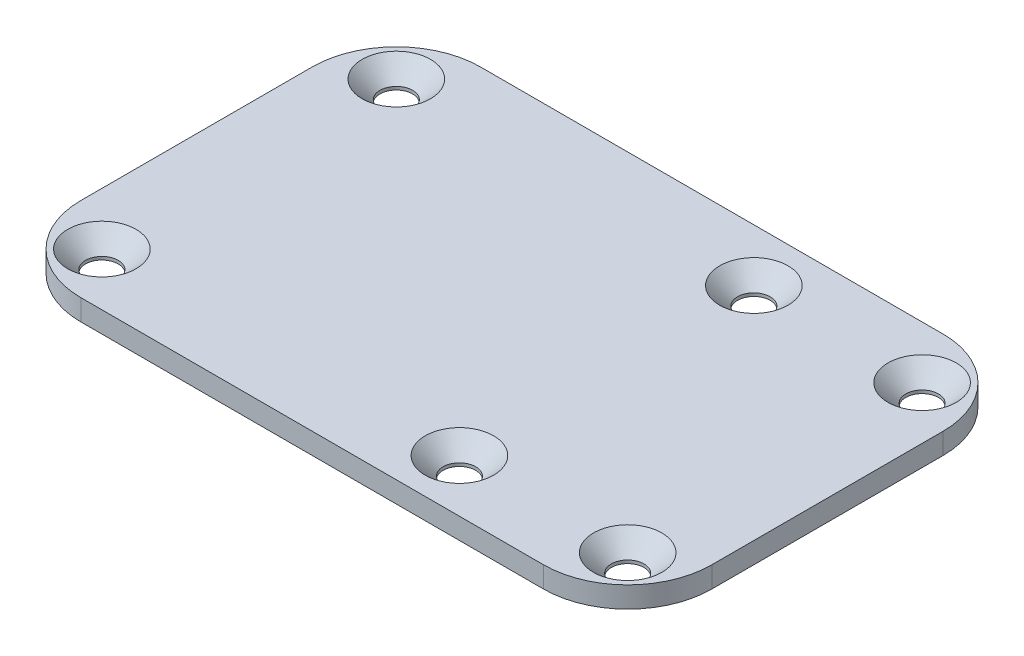
ISO-10303-21;
HEADER;
FILE_DESCRIPTION(('STEP AP214'),'2;1');
FILE_NAME('part.step','',(''),(''),'','','');
FILE_SCHEMA(('AUTOMOTIVE_DESIGN { 1 0 10303 214 1 1 1 1 }'));
ENDSEC;
DATA;
#1=APPLICATION_CONTEXT('core data for automotive mechanical design processes');
#2=APPLICATION_PROTOCOL_DEFINITION('international standard','automotive_design',2000,#1);
#3=PRODUCT_CONTEXT('',#1,'mechanical');
#4=PRODUCT('Part','Part','',(#3));
#5=PRODUCT_RELATED_PRODUCT_CATEGORY('part','',(#4));
#6=PRODUCT_DEFINITION_FORMATION('','',#4);
#7=PRODUCT_DEFINITION_CONTEXT('part definition',#1,'design');
#8=PRODUCT_DEFINITION('design','',#6,#7);
#9=PRODUCT_DEFINITION_SHAPE('','',#8);
#10=(LENGTH_UNIT() NAMED_UNIT(*) SI_UNIT(.MILLI.,.METRE.));
#11=(NAMED_UNIT(*) PLANE_ANGLE_UNIT() SI_UNIT($,.RADIAN.));
#12=(NAMED_UNIT(*) SI_UNIT($,.STERADIAN.) SOLID_ANGLE_UNIT());
#13=UNCERTAINTY_MEASURE_WITH_UNIT(LENGTH_MEASURE(1.E-05),#10,'distance_accuracy_value','');
#14=(GEOMETRIC_REPRESENTATION_CONTEXT(3) GLOBAL_UNCERTAINTY_ASSIGNED_CONTEXT((#13)) GLOBAL_UNIT_ASSIGNED_CONTEXT((#10,
#11,#12)) REPRESENTATION_CONTEXT('',''));
#15=CARTESIAN_POINT('',(0.,0.,0.));
#16=DIRECTION('',(0.,0.,1.));
#17=DIRECTION('',(1.,0.,0.));
#18=AXIS2_PLACEMENT_3D('',#15,#16,#17);
#19=CARTESIAN_POINT('',(22.,2.,-11.));
#20=DIRECTION('',(0.,-1.,0.));
#21=DIRECTION('',(0.,0.,-1.));
#22=AXIS2_PLACEMENT_3D('',#19,#20,#21);
#23=CYLINDRICAL_SURFACE('',#22,8.);
#24=CARTESIAN_POINT('',(22.,0.,-11.));
#25=DIRECTION('',(0.,1.,0.));
#26=DIRECTION('',(0.,0.,1.));
#27=AXIS2_PLACEMENT_3D('',#24,#25,#26);
#28=CIRCLE('',#27,8.);
#29=CARTESIAN_POINT('',(30.,0.,-11.));
#30=VERTEX_POINT('',#29);
#31=CARTESIAN_POINT('',(22.,0.,-19.));
#32=VERTEX_POINT('',#31);
#33=EDGE_CURVE('E130',#30,#32,#28,.T.);
#34=ORIENTED_EDGE('',*,*,#33,.T.);
#35=DIRECTION('',(0.,-1.,0.));
#36=VECTOR('',#35,1.);
#37=CARTESIAN_POINT('',(22.,2.,-19.));
#38=LINE('',#37,#36);
#39=CARTESIAN_POINT('',(22.,2.,-19.));
#40=VERTEX_POINT('',#39);
#41=EDGE_CURVE('E11',#40,#32,#38,.T.);
#42=ORIENTED_EDGE('',*,*,#41,.F.);
#43=CARTESIAN_POINT('',(22.,2.,-11.));
#44=DIRECTION('',(0.,1.,0.));
#45=DIRECTION('',(0.,0.,1.));
#46=AXIS2_PLACEMENT_3D('',#43,#44,#45);
#47=CIRCLE('',#46,8.);
#48=CARTESIAN_POINT('',(30.,2.,-11.));
#49=VERTEX_POINT('',#48);
#50=EDGE_CURVE('E145',#49,#40,#47,.T.);
#51=ORIENTED_EDGE('',*,*,#50,.F.);
#52=DIRECTION('',(0.,-1.,0.));
#53=VECTOR('',#52,1.);
#54=CARTESIAN_POINT('',(30.,2.,-11.));
#55=LINE('',#54,#53);
#56=EDGE_CURVE('E126',#49,#30,#55,.T.);
#57=ORIENTED_EDGE('',*,*,#56,.T.);
#58=EDGE_LOOP('',(#34,#42,#51,#57));
#59=FACE_BOUND('',#58,.T.);
#60=ADVANCED_FACE('F34',(#59),#23,.T.);
#61=CARTESIAN_POINT('',(22.,2.,-19.));
#62=DIRECTION('',(0.,0.,1.));
#63=DIRECTION('',(1.,0.,0.));
#64=AXIS2_PLACEMENT_3D('',#61,#62,#63);
#65=PLANE('',#64);
#66=DIRECTION('',(-1.,0.,0.));
#67=VECTOR('',#66,1.);
#68=CARTESIAN_POINT('',(22.,0.,-19.));
#69=LINE('',#68,#67);
#70=CARTESIAN_POINT('',(-22.,0.,-19.));
#71=VERTEX_POINT('',#70);
#72=EDGE_CURVE('E133',#32,#71,#69,.T.);
#73=ORIENTED_EDGE('',*,*,#72,.T.);
#74=DIRECTION('',(0.,-1.,0.));
#75=VECTOR('',#74,1.);
#76=CARTESIAN_POINT('',(-22.,2.,-19.));
#77=LINE('',#76,#75);
#78=CARTESIAN_POINT('',(-22.,2.,-19.));
#79=VERTEX_POINT('',#78);
#80=EDGE_CURVE('E42',#79,#71,#77,.T.);
#81=ORIENTED_EDGE('',*,*,#80,.F.);
#82=DIRECTION('',(-1.,0.,0.));
#83=VECTOR('',#82,1.);
#84=CARTESIAN_POINT('',(22.,2.,-19.));
#85=LINE('',#84,#83);
#86=EDGE_CURVE('E93',#40,#79,#85,.T.);
#87=ORIENTED_EDGE('',*,*,#86,.F.);
#88=ORIENTED_EDGE('',*,*,#41,.T.);
#89=EDGE_LOOP('',(#73,#81,#87,#88));
#90=FACE_BOUND('',#89,.T.);
#91=ADVANCED_FACE('F265',(#90),#65,.F.);
#92=CARTESIAN_POINT('',(-22.,2.,-11.));
#93=DIRECTION('',(0.,-1.,0.));
#94=DIRECTION('',(0.,0.,-1.));
#95=AXIS2_PLACEMENT_3D('',#92,#93,#94);
#96=CYLINDRICAL_SURFACE('',#95,8.);
#97=CARTESIAN_POINT('',(-22.,0.,-11.));
#98=DIRECTION('',(0.,1.,0.));
#99=DIRECTION('',(0.,0.,1.));
#100=AXIS2_PLACEMENT_3D('',#97,#98,#99);
#101=CIRCLE('',#100,8.);
#102=CARTESIAN_POINT('',(-30.,0.,-11.));
#103=VERTEX_POINT('',#102);
#104=EDGE_CURVE('E136',#71,#103,#101,.T.);
#105=ORIENTED_EDGE('',*,*,#104,.T.);
#106=DIRECTION('',(0.,-1.,0.));
#107=VECTOR('',#106,1.);
#108=CARTESIAN_POINT('',(-30.,2.,-11.));
#109=LINE('',#108,#107);
#110=CARTESIAN_POINT('',(-30.,2.,-11.));
#111=VERTEX_POINT('',#110);
#112=EDGE_CURVE('E152',#111,#103,#109,.T.);
#113=ORIENTED_EDGE('',*,*,#112,.F.);
#114=CARTESIAN_POINT('',(-22.,2.,-11.));
#115=DIRECTION('',(0.,1.,0.));
#116=DIRECTION('',(0.,0.,1.));
#117=AXIS2_PLACEMENT_3D('',#114,#115,#116);
#118=CIRCLE('',#117,8.);
#119=EDGE_CURVE('E160',#79,#111,#118,.T.);
#120=ORIENTED_EDGE('',*,*,#119,.F.);
#121=ORIENTED_EDGE('',*,*,#80,.T.);
#122=EDGE_LOOP('',(#105,#113,#120,#121));
#123=FACE_BOUND('',#122,.T.);
#124=ADVANCED_FACE('F158',(#123),#96,.T.);
#125=CARTESIAN_POINT('',(-30.,2.,11.));
#126=DIRECTION('',(1.,0.,0.));
#127=DIRECTION('',(0.,0.,-1.));
#128=AXIS2_PLACEMENT_3D('',#125,#126,#127);
#129=PLANE('',#128);
#130=DIRECTION('',(0.,0.,1.));
#131=VECTOR('',#130,1.);
#132=CARTESIAN_POINT('',(-30.,0.,11.));
#133=LINE('',#132,#131);
#134=CARTESIAN_POINT('',(-30.,0.,11.));
#135=VERTEX_POINT('',#134);
#136=EDGE_CURVE('E138',#103,#135,#133,.T.);
#137=ORIENTED_EDGE('',*,*,#136,.T.);
#138=DIRECTION('',(0.,-1.,0.));
#139=VECTOR('',#138,1.);
#140=CARTESIAN_POINT('',(-30.,2.,11.));
#141=LINE('',#140,#139);
#142=CARTESIAN_POINT('',(-30.,2.,11.));
#143=VERTEX_POINT('',#142);
#144=EDGE_CURVE('E149',#143,#135,#141,.T.);
#145=ORIENTED_EDGE('',*,*,#144,.F.);
#146=DIRECTION('',(0.,0.,1.));
#147=VECTOR('',#146,1.);
#148=CARTESIAN_POINT('',(-30.,2.,11.));
#149=LINE('',#148,#147);
#150=EDGE_CURVE('E172',#111,#143,#149,.T.);
#151=ORIENTED_EDGE('',*,*,#150,.F.);
#152=ORIENTED_EDGE('',*,*,#112,.T.);
#153=EDGE_LOOP('',(#137,#145,#151,#152));
#154=FACE_BOUND('',#153,.T.);
#155=ADVANCED_FACE('F168',(#154),#129,.F.);
#156=CARTESIAN_POINT('',(-22.,2.,11.));
#157=DIRECTION('',(0.,-1.,0.));
#158=DIRECTION('',(0.,0.,-1.));
#159=AXIS2_PLACEMENT_3D('',#156,#157,#158);
#160=CYLINDRICAL_SURFACE('',#159,8.);
#161=CARTESIAN_POINT('',(-22.,0.,11.));
#162=DIRECTION('',(0.,1.,0.));
#163=DIRECTION('',(0.,0.,-1.));
#164=AXIS2_PLACEMENT_3D('',#161,#162,#163);
#165=CIRCLE('',#164,8.);
#166=CARTESIAN_POINT('',(-22.,0.,19.));
#167=VERTEX_POINT('',#166);
#168=EDGE_CURVE('E140',#135,#167,#165,.T.);
#169=ORIENTED_EDGE('',*,*,#168,.T.);
#170=DIRECTION('',(0.,-1.,0.));
#171=VECTOR('',#170,1.);
#172=CARTESIAN_POINT('',(-22.,2.,19.));
#173=LINE('',#172,#171);
#174=CARTESIAN_POINT('',(-22.,2.,19.));
#175=VERTEX_POINT('',#174);
#176=EDGE_CURVE('E121',#175,#167,#173,.T.);
#177=ORIENTED_EDGE('',*,*,#176,.F.);
#178=CARTESIAN_POINT('',(-22.,2.,11.));
#179=DIRECTION('',(0.,1.,0.));
#180=DIRECTION('',(0.,0.,-1.));
#181=AXIS2_PLACEMENT_3D('',#178,#179,#180);
#182=CIRCLE('',#181,8.);
#183=EDGE_CURVE('E112',#143,#175,#182,.T.);
#184=ORIENTED_EDGE('',*,*,#183,.F.);
#185=ORIENTED_EDGE('',*,*,#144,.T.);
#186=EDGE_LOOP('',(#169,#177,#184,#185));
#187=FACE_BOUND('',#186,.T.);
#188=ADVANCED_FACE('F171',(#187),#160,.T.);
#189=CARTESIAN_POINT('',(22.,2.,19.));
#190=DIRECTION('',(0.,0.,-1.));
#191=DIRECTION('',(-1.,0.,0.));
#192=AXIS2_PLACEMENT_3D('',#189,#190,#191);
#193=PLANE('',#192);
#194=DIRECTION('',(1.,0.,0.));
#195=VECTOR('',#194,1.);
#196=CARTESIAN_POINT('',(22.,0.,19.));
#197=LINE('',#196,#195);
#198=CARTESIAN_POINT('',(22.,0.,19.));
#199=VERTEX_POINT('',#198);
#200=EDGE_CURVE('E120',#167,#199,#197,.T.);
#201=ORIENTED_EDGE('',*,*,#200,.T.);
#202=DIRECTION('',(0.,-1.,0.));
#203=VECTOR('',#202,1.);
#204=CARTESIAN_POINT('',(22.,2.,19.));
#205=LINE('',#204,#203);
#206=CARTESIAN_POINT('',(22.,2.,19.));
#207=VERTEX_POINT('',#206);
#208=EDGE_CURVE('E117',#207,#199,#205,.T.);
#209=ORIENTED_EDGE('',*,*,#208,.F.);
#210=DIRECTION('',(1.,0.,0.));
#211=VECTOR('',#210,1.);
#212=CARTESIAN_POINT('',(22.,2.,19.));
#213=LINE('',#212,#211);
#214=EDGE_CURVE('E106',#175,#207,#213,.T.);
#215=ORIENTED_EDGE('',*,*,#214,.F.);
#216=ORIENTED_EDGE('',*,*,#176,.T.);
#217=EDGE_LOOP('',(#201,#209,#215,#216));
#218=FACE_BOUND('',#217,.T.);
#219=ADVANCED_FACE('F118',(#218),#193,.F.);
#220=CARTESIAN_POINT('',(22.,2.,11.));
#221=DIRECTION('',(0.,-1.,0.));
#222=DIRECTION('',(0.,0.,-1.));
#223=AXIS2_PLACEMENT_3D('',#220,#221,#222);
#224=CYLINDRICAL_SURFACE('',#223,8.);
#225=CARTESIAN_POINT('',(22.,0.,11.));
#226=DIRECTION('',(0.,1.,0.));
#227=DIRECTION('',(0.,0.,1.));
#228=AXIS2_PLACEMENT_3D('',#225,#226,#227);
#229=CIRCLE('',#228,8.);
#230=CARTESIAN_POINT('',(30.,0.,11.));
#231=VERTEX_POINT('',#230);
#232=EDGE_CURVE('E79',#199,#231,#229,.T.);
#233=ORIENTED_EDGE('',*,*,#232,.T.);
#234=DIRECTION('',(0.,-1.,0.));
#235=VECTOR('',#234,1.);
#236=CARTESIAN_POINT('',(30.,2.,11.));
#237=LINE('',#236,#235);
#238=CARTESIAN_POINT('',(30.,2.,11.));
#239=VERTEX_POINT('',#238);
#240=EDGE_CURVE('E122',#239,#231,#237,.T.);
#241=ORIENTED_EDGE('',*,*,#240,.F.);
#242=CARTESIAN_POINT('',(22.,2.,11.));
#243=DIRECTION('',(0.,1.,0.));
#244=DIRECTION('',(0.,0.,1.));
#245=AXIS2_PLACEMENT_3D('',#242,#243,#244);
#246=CIRCLE('',#245,8.);
#247=EDGE_CURVE('E110',#207,#239,#246,.T.);
#248=ORIENTED_EDGE('',*,*,#247,.F.);
#249=ORIENTED_EDGE('',*,*,#208,.T.);
#250=EDGE_LOOP('',(#233,#241,#248,#249));
#251=FACE_BOUND('',#250,.T.);
#252=ADVANCED_FACE('F124',(#251),#224,.T.);
#253=CARTESIAN_POINT('',(30.,2.,11.));
#254=DIRECTION('',(-1.,0.,0.));
#255=DIRECTION('',(0.,0.,1.));
#256=AXIS2_PLACEMENT_3D('',#253,#254,#255);
#257=PLANE('',#256);
#258=DIRECTION('',(0.,0.,-1.));
#259=VECTOR('',#258,1.);
#260=CARTESIAN_POINT('',(30.,0.,11.));
#261=LINE('',#260,#259);
#262=EDGE_CURVE('E85',#231,#30,#261,.T.);
#263=ORIENTED_EDGE('',*,*,#262,.T.);
#264=ORIENTED_EDGE('',*,*,#56,.F.);
#265=DIRECTION('',(0.,0.,-1.));
#266=VECTOR('',#265,1.);
#267=CARTESIAN_POINT('',(30.,2.,11.));
#268=LINE('',#267,#266);
#269=EDGE_CURVE('E50',#239,#49,#268,.T.);
#270=ORIENTED_EDGE('',*,*,#269,.F.);
#271=ORIENTED_EDGE('',*,*,#240,.T.);
#272=EDGE_LOOP('',(#263,#264,#270,#271));
#273=FACE_BOUND('',#272,.T.);
#274=ADVANCED_FACE('F236',(#273),#257,.F.);
#275=CARTESIAN_POINT('',(22.,2.,-11.));
#276=DIRECTION('',(0.,1.,0.));
#277=DIRECTION('',(0.,0.,1.));
#278=AXIS2_PLACEMENT_3D('',#275,#276,#277);
#279=PLANE('',#278);
#280=CARTESIAN_POINT('',(25.,2.,-14.));
#281=DIRECTION('',(0.,1.,0.));
#282=DIRECTION('',(0.,0.,1.));
#283=AXIS2_PLACEMENT_3D('',#280,#281,#282);
#284=CIRCLE('',#283,3.25);
#285=CARTESIAN_POINT('',(25.,2.,-10.75));
#286=VERTEX_POINT('',#285);
#287=EDGE_CURVE('E228',#286,#286,#284,.T.);
#288=ORIENTED_EDGE('',*,*,#287,.F.);
#289=EDGE_LOOP('',(#288));
#290=FACE_BOUND('',#289,.T.);
#291=CARTESIAN_POINT('',(25.,2.,14.));
#292=DIRECTION('',(0.,1.,0.));
#293=DIRECTION('',(0.,0.,1.));
#294=AXIS2_PLACEMENT_3D('',#291,#292,#293);
#295=CIRCLE('',#294,3.25);
#296=CARTESIAN_POINT('',(25.,2.,17.25));
#297=VERTEX_POINT('',#296);
#298=EDGE_CURVE('E219',#297,#297,#295,.T.);
#299=ORIENTED_EDGE('',*,*,#298,.F.);
#300=EDGE_LOOP('',(#299));
#301=FACE_BOUND('',#300,.T.);
#302=CARTESIAN_POINT('',(-25.,2.,14.));
#303=DIRECTION('',(0.,1.,0.));
#304=DIRECTION('',(0.,0.,1.));
#305=AXIS2_PLACEMENT_3D('',#302,#303,#304);
#306=CIRCLE('',#305,3.25);
#307=CARTESIAN_POINT('',(-25.,2.,17.25));
#308=VERTEX_POINT('',#307);
#309=EDGE_CURVE('E210',#308,#308,#306,.T.);
#310=ORIENTED_EDGE('',*,*,#309,.F.);
#311=EDGE_LOOP('',(#310));
#312=FACE_BOUND('',#311,.T.);
#313=CARTESIAN_POINT('',(-25.,2.,-14.));
#314=DIRECTION('',(0.,1.,0.));
#315=DIRECTION('',(0.,0.,1.));
#316=AXIS2_PLACEMENT_3D('',#313,#314,#315);
#317=CIRCLE('',#316,3.25);
#318=CARTESIAN_POINT('',(-25.,2.,-10.75));
#319=VERTEX_POINT('',#318);
#320=EDGE_CURVE('E201',#319,#319,#317,.T.);
#321=ORIENTED_EDGE('',*,*,#320,.F.);
#322=EDGE_LOOP('',(#321));
#323=FACE_BOUND('',#322,.T.);
#324=CARTESIAN_POINT('',(9.,2.,-14.));
#325=DIRECTION('',(0.,1.,0.));
#326=DIRECTION('',(0.,0.,1.));
#327=AXIS2_PLACEMENT_3D('',#324,#325,#326);
#328=CIRCLE('',#327,3.25);
#329=CARTESIAN_POINT('',(9.,2.,-10.75));
#330=VERTEX_POINT('',#329);
#331=EDGE_CURVE('E192',#330,#330,#328,.T.);
#332=ORIENTED_EDGE('',*,*,#331,.F.);
#333=EDGE_LOOP('',(#332));
#334=FACE_BOUND('',#333,.T.);
#335=CARTESIAN_POINT('',(9.,2.,14.));
#336=DIRECTION('',(0.,1.,0.));
#337=DIRECTION('',(0.,0.,1.));
#338=AXIS2_PLACEMENT_3D('',#335,#336,#337);
#339=CIRCLE('',#338,3.25);
#340=CARTESIAN_POINT('',(9.,2.,17.25));
#341=VERTEX_POINT('',#340);
#342=EDGE_CURVE('E183',#341,#341,#339,.T.);
#343=ORIENTED_EDGE('',*,*,#342,.F.);
#344=EDGE_LOOP('',(#343));
#345=FACE_BOUND('',#344,.T.);
#346=ORIENTED_EDGE('',*,*,#50,.T.);
#347=ORIENTED_EDGE('',*,*,#86,.T.);
#348=ORIENTED_EDGE('',*,*,#119,.T.);
#349=ORIENTED_EDGE('',*,*,#150,.T.);
#350=ORIENTED_EDGE('',*,*,#183,.T.);
#351=ORIENTED_EDGE('',*,*,#214,.T.);
#352=ORIENTED_EDGE('',*,*,#247,.T.);
#353=ORIENTED_EDGE('',*,*,#269,.T.);
#354=EDGE_LOOP('',(#346,#347,#348,#349,#350,#351,#352,#353));
#355=FACE_BOUND('',#354,.T.);
#356=ADVANCED_FACE('F108',(#290,#301,#312,#323,#334,#345,#355),#279,.T.);
#357=CARTESIAN_POINT('',(22.,0.,-11.));
#358=DIRECTION('',(0.,1.,0.));
#359=DIRECTION('',(0.,0.,1.));
#360=AXIS2_PLACEMENT_3D('',#357,#358,#359);
#361=PLANE('',#360);
#362=CARTESIAN_POINT('',(25.,0.,-14.));
#363=DIRECTION('',(0.,1.,0.));
#364=DIRECTION('',(0.,0.,1.));
#365=AXIS2_PLACEMENT_3D('',#362,#363,#364);
#366=CIRCLE('',#365,1.55);
#367=CARTESIAN_POINT('',(25.,0.,-12.45));
#368=VERTEX_POINT('',#367);
#369=EDGE_CURVE('E222',#368,#368,#366,.T.);
#370=ORIENTED_EDGE('',*,*,#369,.T.);
#371=EDGE_LOOP('',(#370));
#372=FACE_BOUND('',#371,.T.);
#373=CARTESIAN_POINT('',(25.,0.,14.));
#374=DIRECTION('',(0.,1.,0.));
#375=DIRECTION('',(0.,0.,1.));
#376=AXIS2_PLACEMENT_3D('',#373,#374,#375);
#377=CIRCLE('',#376,1.55);
#378=CARTESIAN_POINT('',(25.,0.,15.55));
#379=VERTEX_POINT('',#378);
#380=EDGE_CURVE('E213',#379,#379,#377,.T.);
#381=ORIENTED_EDGE('',*,*,#380,.T.);
#382=EDGE_LOOP('',(#381));
#383=FACE_BOUND('',#382,.T.);
#384=CARTESIAN_POINT('',(-25.,0.,14.));
#385=DIRECTION('',(0.,1.,0.));
#386=DIRECTION('',(0.,0.,1.));
#387=AXIS2_PLACEMENT_3D('',#384,#385,#386);
#388=CIRCLE('',#387,1.55);
#389=CARTESIAN_POINT('',(-25.,0.,15.55));
#390=VERTEX_POINT('',#389);
#391=EDGE_CURVE('E204',#390,#390,#388,.T.);
#392=ORIENTED_EDGE('',*,*,#391,.T.);
#393=EDGE_LOOP('',(#392));
#394=FACE_BOUND('',#393,.T.);
#395=CARTESIAN_POINT('',(-25.,0.,-14.));
#396=DIRECTION('',(0.,1.,0.));
#397=DIRECTION('',(0.,0.,1.));
#398=AXIS2_PLACEMENT_3D('',#395,#396,#397);
#399=CIRCLE('',#398,1.55);
#400=CARTESIAN_POINT('',(-25.,0.,-12.45));
#401=VERTEX_POINT('',#400);
#402=EDGE_CURVE('E195',#401,#401,#399,.T.);
#403=ORIENTED_EDGE('',*,*,#402,.T.);
#404=EDGE_LOOP('',(#403));
#405=FACE_BOUND('',#404,.T.);
#406=CARTESIAN_POINT('',(9.,0.,-14.));
#407=DIRECTION('',(0.,1.,0.));
#408=DIRECTION('',(0.,0.,1.));
#409=AXIS2_PLACEMENT_3D('',#406,#407,#408);
#410=CIRCLE('',#409,1.55);
#411=CARTESIAN_POINT('',(9.,0.,-12.45));
#412=VERTEX_POINT('',#411);
#413=EDGE_CURVE('E186',#412,#412,#410,.T.);
#414=ORIENTED_EDGE('',*,*,#413,.T.);
#415=EDGE_LOOP('',(#414));
#416=FACE_BOUND('',#415,.T.);
#417=CARTESIAN_POINT('',(9.,0.,14.));
#418=DIRECTION('',(0.,1.,0.));
#419=DIRECTION('',(0.,0.,1.));
#420=AXIS2_PLACEMENT_3D('',#417,#418,#419);
#421=CIRCLE('',#420,1.55);
#422=CARTESIAN_POINT('',(9.,0.,15.55));
#423=VERTEX_POINT('',#422);
#424=EDGE_CURVE('E134',#423,#423,#421,.T.);
#425=ORIENTED_EDGE('',*,*,#424,.T.);
#426=EDGE_LOOP('',(#425));
#427=FACE_BOUND('',#426,.T.);
#428=ORIENTED_EDGE('',*,*,#33,.F.);
#429=ORIENTED_EDGE('',*,*,#262,.F.);
#430=ORIENTED_EDGE('',*,*,#232,.F.);
#431=ORIENTED_EDGE('',*,*,#200,.F.);
#432=ORIENTED_EDGE('',*,*,#168,.F.);
#433=ORIENTED_EDGE('',*,*,#136,.F.);
#434=ORIENTED_EDGE('',*,*,#104,.F.);
#435=ORIENTED_EDGE('',*,*,#72,.F.);
#436=EDGE_LOOP('',(#428,#429,#430,#431,#432,#433,#434,#435));
#437=FACE_BOUND('',#436,.T.);
#438=ADVANCED_FACE('F164',(#372,#383,#394,#405,#416,#427,#437),#361,.F.);
#439=CARTESIAN_POINT('',(9.,2.,14.));
#440=DIRECTION('',(0.,1.,0.));
#441=DIRECTION('',(0.,0.,1.));
#442=AXIS2_PLACEMENT_3D('',#439,#440,#441);
#443=CYLINDRICAL_SURFACE('',#442,1.55);
#444=ORIENTED_EDGE('',*,*,#424,.F.);
#445=EDGE_LOOP('',(#444));
#446=FACE_BOUND('',#445,.T.);
#447=CARTESIAN_POINT('',(9.,0.300000000000001,14.));
#448=DIRECTION('',(0.,1.,0.));
#449=DIRECTION('',(0.,0.,1.));
#450=AXIS2_PLACEMENT_3D('',#447,#448,#449);
#451=CIRCLE('',#450,1.55);
#452=CARTESIAN_POINT('',(9.,0.300000000000001,15.55));
#453=VERTEX_POINT('',#452);
#454=EDGE_CURVE('E180',#453,#453,#451,.T.);
#455=ORIENTED_EDGE('',*,*,#454,.T.);
#456=EDGE_LOOP('',(#455));
#457=FACE_BOUND('',#456,.T.);
#458=ADVANCED_FACE('F251',(#446,#457),#443,.F.);
#459=CARTESIAN_POINT('',(9.,2.,14.));
#460=DIRECTION('',(0.,1.,0.));
#461=DIRECTION('',(0.,0.,1.));
#462=AXIS2_PLACEMENT_3D('',#459,#460,#461);
#463=CONICAL_SURFACE('',#462,3.25,0.785398163397449);
#464=ORIENTED_EDGE('',*,*,#454,.F.);
#465=EDGE_LOOP('',(#464));
#466=FACE_BOUND('',#465,.T.);
#467=ORIENTED_EDGE('',*,*,#342,.T.);
#468=EDGE_LOOP('',(#467));
#469=FACE_BOUND('',#468,.T.);
#470=ADVANCED_FACE('F248',(#466,#469),#463,.F.);
#471=CARTESIAN_POINT('',(9.,2.,-14.));
#472=DIRECTION('',(0.,1.,0.));
#473=DIRECTION('',(0.,0.,1.));
#474=AXIS2_PLACEMENT_3D('',#471,#472,#473);
#475=CYLINDRICAL_SURFACE('',#474,1.55);
#476=ORIENTED_EDGE('',*,*,#413,.F.);
#477=EDGE_LOOP('',(#476));
#478=FACE_BOUND('',#477,.T.);
#479=CARTESIAN_POINT('',(9.,0.300000000000001,-14.));
#480=DIRECTION('',(0.,1.,0.));
#481=DIRECTION('',(0.,0.,1.));
#482=AXIS2_PLACEMENT_3D('',#479,#480,#481);
#483=CIRCLE('',#482,1.55);
#484=CARTESIAN_POINT('',(9.,0.300000000000001,-12.45));
#485=VERTEX_POINT('',#484);
#486=EDGE_CURVE('E189',#485,#485,#483,.T.);
#487=ORIENTED_EDGE('',*,*,#486,.T.);
#488=EDGE_LOOP('',(#487));
#489=FACE_BOUND('',#488,.T.);
#490=ADVANCED_FACE('F250',(#478,#489),#475,.F.);
#491=CARTESIAN_POINT('',(9.,2.,-14.));
#492=DIRECTION('',(0.,1.,0.));
#493=DIRECTION('',(0.,0.,1.));
#494=AXIS2_PLACEMENT_3D('',#491,#492,#493);
#495=CONICAL_SURFACE('',#494,3.25,0.785398163397449);
#496=ORIENTED_EDGE('',*,*,#486,.F.);
#497=EDGE_LOOP('',(#496));
#498=FACE_BOUND('',#497,.T.);
#499=ORIENTED_EDGE('',*,*,#331,.T.);
#500=EDGE_LOOP('',(#499));
#501=FACE_BOUND('',#500,.T.);
#502=ADVANCED_FACE('F258',(#498,#501),#495,.F.);
#503=CARTESIAN_POINT('',(-25.,2.,-14.));
#504=DIRECTION('',(0.,1.,0.));
#505=DIRECTION('',(0.,0.,1.));
#506=AXIS2_PLACEMENT_3D('',#503,#504,#505);
#507=CYLINDRICAL_SURFACE('',#506,1.55);
#508=ORIENTED_EDGE('',*,*,#402,.F.);
#509=EDGE_LOOP('',(#508));
#510=FACE_BOUND('',#509,.T.);
#511=CARTESIAN_POINT('',(-25.,0.300000000000001,-14.));
#512=DIRECTION('',(0.,1.,0.));
#513=DIRECTION('',(0.,0.,1.));
#514=AXIS2_PLACEMENT_3D('',#511,#512,#513);
#515=CIRCLE('',#514,1.55);
#516=CARTESIAN_POINT('',(-25.,0.300000000000001,-12.45));
#517=VERTEX_POINT('',#516);
#518=EDGE_CURVE('E198',#517,#517,#515,.T.);
#519=ORIENTED_EDGE('',*,*,#518,.T.);
#520=EDGE_LOOP('',(#519));
#521=FACE_BOUND('',#520,.T.);
#522=ADVANCED_FACE('F350',(#510,#521),#507,.F.);
#523=CARTESIAN_POINT('',(-25.,2.,-14.));
#524=DIRECTION('',(0.,1.,0.));
#525=DIRECTION('',(0.,0.,1.));
#526=AXIS2_PLACEMENT_3D('',#523,#524,#525);
#527=CONICAL_SURFACE('',#526,3.25,0.785398163397449);
#528=ORIENTED_EDGE('',*,*,#518,.F.);
#529=EDGE_LOOP('',(#528));
#530=FACE_BOUND('',#529,.T.);
#531=ORIENTED_EDGE('',*,*,#320,.T.);
#532=EDGE_LOOP('',(#531));
#533=FACE_BOUND('',#532,.T.);
#534=ADVANCED_FACE('F360',(#530,#533),#527,.F.);
#535=CARTESIAN_POINT('',(-25.,2.,14.));
#536=DIRECTION('',(0.,1.,0.));
#537=DIRECTION('',(0.,0.,1.));
#538=AXIS2_PLACEMENT_3D('',#535,#536,#537);
#539=CYLINDRICAL_SURFACE('',#538,1.55);
#540=ORIENTED_EDGE('',*,*,#391,.F.);
#541=EDGE_LOOP('',(#540));
#542=FACE_BOUND('',#541,.T.);
#543=CARTESIAN_POINT('',(-25.,0.300000000000001,14.));
#544=DIRECTION('',(0.,1.,0.));
#545=DIRECTION('',(0.,0.,1.));
#546=AXIS2_PLACEMENT_3D('',#543,#544,#545);
#547=CIRCLE('',#546,1.55);
#548=CARTESIAN_POINT('',(-25.,0.300000000000001,15.55));
#549=VERTEX_POINT('',#548);
#550=EDGE_CURVE('E207',#549,#549,#547,.T.);
#551=ORIENTED_EDGE('',*,*,#550,.T.);
#552=EDGE_LOOP('',(#551));
#553=FACE_BOUND('',#552,.T.);
#554=ADVANCED_FACE('F370',(#542,#553),#539,.F.);
#555=CARTESIAN_POINT('',(-25.,2.,14.));
#556=DIRECTION('',(0.,1.,0.));
#557=DIRECTION('',(0.,0.,1.));
#558=AXIS2_PLACEMENT_3D('',#555,#556,#557);
#559=CONICAL_SURFACE('',#558,3.25,0.785398163397449);
#560=ORIENTED_EDGE('',*,*,#550,.F.);
#561=EDGE_LOOP('',(#560));
#562=FACE_BOUND('',#561,.T.);
#563=ORIENTED_EDGE('',*,*,#309,.T.);
#564=EDGE_LOOP('',(#563));
#565=FACE_BOUND('',#564,.T.);
#566=ADVANCED_FACE('F380',(#562,#565),#559,.F.);
#567=CARTESIAN_POINT('',(25.,2.,14.));
#568=DIRECTION('',(0.,1.,0.));
#569=DIRECTION('',(0.,0.,1.));
#570=AXIS2_PLACEMENT_3D('',#567,#568,#569);
#571=CYLINDRICAL_SURFACE('',#570,1.55);
#572=ORIENTED_EDGE('',*,*,#380,.F.);
#573=EDGE_LOOP('',(#572));
#574=FACE_BOUND('',#573,.T.);
#575=CARTESIAN_POINT('',(25.,0.300000000000001,14.));
#576=DIRECTION('',(0.,1.,0.));
#577=DIRECTION('',(0.,0.,1.));
#578=AXIS2_PLACEMENT_3D('',#575,#576,#577);
#579=CIRCLE('',#578,1.55);
#580=CARTESIAN_POINT('',(25.,0.300000000000001,15.55));
#581=VERTEX_POINT('',#580);
#582=EDGE_CURVE('E216',#581,#581,#579,.T.);
#583=ORIENTED_EDGE('',*,*,#582,.T.);
#584=EDGE_LOOP('',(#583));
#585=FACE_BOUND('',#584,.T.);
#586=ADVANCED_FACE('F390',(#574,#585),#571,.F.);
#587=CARTESIAN_POINT('',(25.,2.,14.));
#588=DIRECTION('',(0.,1.,0.));
#589=DIRECTION('',(0.,0.,1.));
#590=AXIS2_PLACEMENT_3D('',#587,#588,#589);
#591=CONICAL_SURFACE('',#590,3.25,0.785398163397449);
#592=ORIENTED_EDGE('',*,*,#582,.F.);
#593=EDGE_LOOP('',(#592));
#594=FACE_BOUND('',#593,.T.);
#595=ORIENTED_EDGE('',*,*,#298,.T.);
#596=EDGE_LOOP('',(#595));
#597=FACE_BOUND('',#596,.T.);
#598=ADVANCED_FACE('F400',(#594,#597),#591,.F.);
#599=CARTESIAN_POINT('',(25.,2.,-14.));
#600=DIRECTION('',(0.,1.,0.));
#601=DIRECTION('',(0.,0.,1.));
#602=AXIS2_PLACEMENT_3D('',#599,#600,#601);
#603=CYLINDRICAL_SURFACE('',#602,1.55);
#604=ORIENTED_EDGE('',*,*,#369,.F.);
#605=EDGE_LOOP('',(#604));
#606=FACE_BOUND('',#605,.T.);
#607=CARTESIAN_POINT('',(25.,0.300000000000001,-14.));
#608=DIRECTION('',(0.,1.,0.));
#609=DIRECTION('',(0.,0.,1.));
#610=AXIS2_PLACEMENT_3D('',#607,#608,#609);
#611=CIRCLE('',#610,1.55);
#612=CARTESIAN_POINT('',(25.,0.300000000000001,-12.45));
#613=VERTEX_POINT('',#612);
#614=EDGE_CURVE('E225',#613,#613,#611,.T.);
#615=ORIENTED_EDGE('',*,*,#614,.T.);
#616=EDGE_LOOP('',(#615));
#617=FACE_BOUND('',#616,.T.);
#618=ADVANCED_FACE('F410',(#606,#617),#603,.F.);
#619=CARTESIAN_POINT('',(25.,2.,-14.));
#620=DIRECTION('',(0.,1.,0.));
#621=DIRECTION('',(0.,0.,1.));
#622=AXIS2_PLACEMENT_3D('',#619,#620,#621);
#623=CONICAL_SURFACE('',#622,3.25,0.785398163397449);
#624=ORIENTED_EDGE('',*,*,#614,.F.);
#625=EDGE_LOOP('',(#624));
#626=FACE_BOUND('',#625,.T.);
#627=ORIENTED_EDGE('',*,*,#287,.T.);
#628=EDGE_LOOP('',(#627));
#629=FACE_BOUND('',#628,.T.);
#630=ADVANCED_FACE('F232',(#626,#629),#623,.F.);
#631=CLOSED_SHELL('',(#60,#91,#124,#155,#188,#219,#252,#274,#356,#438,#458,#470,#490,#502,#522,
#534,#554,#566,#586,#598,#618,#630));
#632=MANIFOLD_SOLID_BREP('B2',#631);
#633=ADVANCED_BREP_SHAPE_REPRESENTATION('',(#18,#632),#14);
#634=SHAPE_DEFINITION_REPRESENTATION(#9,#633);
ENDSEC;
END-ISO-10303-21;
